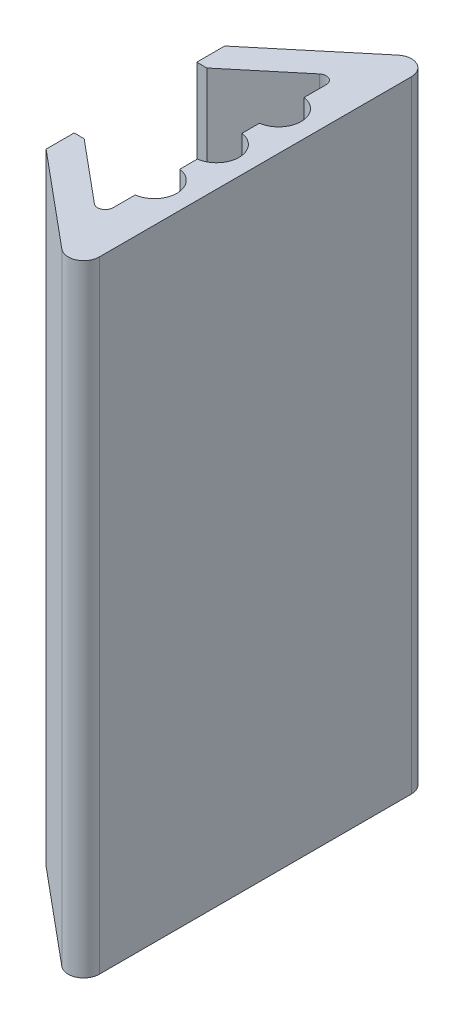
ISO-10303-21;
HEADER;
FILE_DESCRIPTION(('STEP AP214'),'2;1');
FILE_NAME('part.step','',(''),(''),'','','');
FILE_SCHEMA(('AUTOMOTIVE_DESIGN { 1 0 10303 214 1 1 1 1 }'));
ENDSEC;
DATA;
#1=APPLICATION_CONTEXT('core data for automotive mechanical design processes');
#2=APPLICATION_PROTOCOL_DEFINITION('international standard','automotive_design',2000,#1);
#3=PRODUCT_CONTEXT('',#1,'mechanical');
#4=PRODUCT('Part','Part','',(#3));
#5=PRODUCT_RELATED_PRODUCT_CATEGORY('part','',(#4));
#6=PRODUCT_DEFINITION_FORMATION('','',#4);
#7=PRODUCT_DEFINITION_CONTEXT('part definition',#1,'design');
#8=PRODUCT_DEFINITION('design','',#6,#7);
#9=PRODUCT_DEFINITION_SHAPE('','',#8);
#10=(LENGTH_UNIT() NAMED_UNIT(*) SI_UNIT(.MILLI.,.METRE.));
#11=(NAMED_UNIT(*) PLANE_ANGLE_UNIT() SI_UNIT($,.RADIAN.));
#12=(NAMED_UNIT(*) SI_UNIT($,.STERADIAN.) SOLID_ANGLE_UNIT());
#13=UNCERTAINTY_MEASURE_WITH_UNIT(LENGTH_MEASURE(1.E-05),#10,'distance_accuracy_value','');
#14=(GEOMETRIC_REPRESENTATION_CONTEXT(3) GLOBAL_UNCERTAINTY_ASSIGNED_CONTEXT((#13)) GLOBAL_UNIT_ASSIGNED_CONTEXT((#10,
#11,#12)) REPRESENTATION_CONTEXT('',''));
#15=CARTESIAN_POINT('',(0.,0.,0.));
#16=DIRECTION('',(0.,0.,1.));
#17=DIRECTION('',(1.,0.,0.));
#18=AXIS2_PLACEMENT_3D('',#15,#16,#17);
#19=CARTESIAN_POINT('',(29.4000000000002,80.,-3.94148179925068E-13));
#20=DIRECTION('',(-1.,0.,0.));
#21=DIRECTION('',(0.,0.,1.));
#22=AXIS2_PLACEMENT_3D('',#19,#20,#21);
#23=PLANE('',#22);
#24=DIRECTION('',(0.,0.,-1.));
#25=VECTOR('',#24,1.);
#26=CARTESIAN_POINT('',(29.4000000000002,0.,-3.94148179925068E-13));
#27=LINE('',#26,#25);
#28=CARTESIAN_POINT('',(29.4000000000003,0.,13.7189750324093));
#29=VERTEX_POINT('',#28);
#30=CARTESIAN_POINT('',(29.4000000000003,0.,10.872281323269));
#31=VERTEX_POINT('',#30);
#32=EDGE_CURVE('E200',#29,#31,#27,.T.);
#33=ORIENTED_EDGE('',*,*,#32,.F.);
#34=DIRECTION('',(0.,-1.,0.));
#35=VECTOR('',#34,1.);
#36=CARTESIAN_POINT('',(29.4000000000003,80.,13.7189750324093));
#37=LINE('',#36,#35);
#38=CARTESIAN_POINT('',(29.4000000000003,80.,13.7189750324093));
#39=VERTEX_POINT('',#38);
#40=EDGE_CURVE('E11',#39,#29,#37,.T.);
#41=ORIENTED_EDGE('',*,*,#40,.F.);
#42=DIRECTION('',(0.,0.,-1.));
#43=VECTOR('',#42,1.);
#44=CARTESIAN_POINT('',(29.4000000000002,80.,-3.94148179925068E-13));
#45=LINE('',#44,#43);
#46=CARTESIAN_POINT('',(29.4000000000003,80.,10.872281323269));
#47=VERTEX_POINT('',#46);
#48=EDGE_CURVE('E255',#39,#47,#45,.T.);
#49=ORIENTED_EDGE('',*,*,#48,.T.);
#50=DIRECTION('',(0.,-1.,0.));
#51=VECTOR('',#50,1.);
#52=CARTESIAN_POINT('',(29.4000000000003,80.,10.872281323269));
#53=LINE('',#52,#51);
#54=EDGE_CURVE('E50',#47,#31,#53,.T.);
#55=ORIENTED_EDGE('',*,*,#54,.T.);
#56=EDGE_LOOP('',(#33,#41,#49,#55));
#57=FACE_BOUND('',#56,.T.);
#58=ADVANCED_FACE('F34',(#57),#23,.T.);
#59=CARTESIAN_POINT('',(28.4000000000003,80.,13.7189750324093));
#60=DIRECTION('',(0.,-1.,0.));
#61=DIRECTION('',(0.,0.,-1.));
#62=AXIS2_PLACEMENT_3D('',#59,#60,#61);
#63=CYLINDRICAL_SURFACE('',#62,1.00000000000011);
#64=CARTESIAN_POINT('',(28.4000000000003,0.,13.7189750324093));
#65=DIRECTION('',(0.,1.,0.));
#66=DIRECTION('',(0.,0.,1.));
#67=AXIS2_PLACEMENT_3D('',#64,#65,#66);
#68=CIRCLE('',#67,1.00000000000011);
#69=CARTESIAN_POINT('',(27.7598156003355,0.,14.4871963120067));
#70=VERTEX_POINT('',#69);
#71=EDGE_CURVE('E202',#29,#70,#68,.F.);
#72=ORIENTED_EDGE('',*,*,#71,.T.);
#73=DIRECTION('',(0.,-1.,0.));
#74=VECTOR('',#73,1.);
#75=CARTESIAN_POINT('',(27.7598156003355,80.,14.4871963120067));
#76=LINE('',#75,#74);
#77=CARTESIAN_POINT('',(27.7598156003355,80.,14.4871963120067));
#78=VERTEX_POINT('',#77);
#79=EDGE_CURVE('E42',#78,#70,#76,.T.);
#80=ORIENTED_EDGE('',*,*,#79,.F.);
#81=CARTESIAN_POINT('',(28.4000000000003,80.,13.7189750324093));
#82=DIRECTION('',(0.,1.,0.));
#83=DIRECTION('',(0.,0.,1.));
#84=AXIS2_PLACEMENT_3D('',#81,#82,#83);
#85=CIRCLE('',#84,1.00000000000011);
#86=EDGE_CURVE('E569',#39,#78,#85,.F.);
#87=ORIENTED_EDGE('',*,*,#86,.F.);
#88=ORIENTED_EDGE('',*,*,#40,.T.);
#89=EDGE_LOOP('',(#72,#80,#87,#88));
#90=FACE_BOUND('',#89,.T.);
#91=ADVANCED_FACE('F296',(#90),#63,.F.);
#92=CARTESIAN_POINT('',(4.25212296144578,80.,-5.1025475537349));
#93=DIRECTION('',(0.640184399664482,0.,-0.768221279597374));
#94=DIRECTION('',(-0.768221279597374,0.,-0.640184399664482));
#95=AXIS2_PLACEMENT_3D('',#92,#93,#94);
#96=PLANE('',#95);
#97=DIRECTION('',(0.768221279597374,0.,0.640184399664483));
#98=VECTOR('',#97,1.);
#99=CARTESIAN_POINT('',(4.25212296144578,0.,-5.1025475537349));
#100=LINE('',#99,#98);
#101=CARTESIAN_POINT('',(19.8458182064329,0.,7.89219848375448));
#102=VERTEX_POINT('',#101);
#103=EDGE_CURVE('E205',#102,#70,#100,.T.);
#104=ORIENTED_EDGE('',*,*,#103,.F.);
#105=DIRECTION('',(0.,-1.,0.));
#106=VECTOR('',#105,1.);
#107=CARTESIAN_POINT('',(19.8458182064329,80.,7.89219848375448));
#108=LINE('',#107,#106);
#109=CARTESIAN_POINT('',(19.8458182064329,80.,7.89219848375448));
#110=VERTEX_POINT('',#109);
#111=EDGE_CURVE('E286',#110,#102,#108,.T.);
#112=ORIENTED_EDGE('',*,*,#111,.F.);
#113=DIRECTION('',(0.768221279597374,0.,0.640184399664483));
#114=VECTOR('',#113,1.);
#115=CARTESIAN_POINT('',(4.25212296144578,80.,-5.1025475537349));
#116=LINE('',#115,#114);
#117=EDGE_CURVE('E293',#110,#78,#116,.T.);
#118=ORIENTED_EDGE('',*,*,#117,.T.);
#119=ORIENTED_EDGE('',*,*,#79,.T.);
#120=EDGE_LOOP('',(#104,#112,#118,#119));
#121=FACE_BOUND('',#120,.T.);
#122=ADVANCED_FACE('F291',(#121),#96,.T.);
#123=CARTESIAN_POINT('',(1.48120780114814E-13,80.,7.89219848375486));
#124=DIRECTION('',(0.,0.,1.));
#125=DIRECTION('',(1.,0.,0.));
#126=AXIS2_PLACEMENT_3D('',#123,#124,#125);
#127=PLANE('',#126);
#128=DIRECTION('',(-1.,0.,0.));
#129=VECTOR('',#128,1.);
#130=CARTESIAN_POINT('',(1.48120780114814E-13,0.,7.89219848375486));
#131=LINE('',#130,#129);
#132=CARTESIAN_POINT('',(18.5518002592741,0.,7.89219848375451));
#133=VERTEX_POINT('',#132);
#134=EDGE_CURVE('E208',#102,#133,#131,.T.);
#135=ORIENTED_EDGE('',*,*,#134,.T.);
#136=DIRECTION('',(0.,-1.,0.));
#137=VECTOR('',#136,1.);
#138=CARTESIAN_POINT('',(18.5518002592741,80.,7.89219848375451));
#139=LINE('',#138,#137);
#140=CARTESIAN_POINT('',(18.5518002592741,80.,7.89219848375451));
#141=VERTEX_POINT('',#140);
#142=EDGE_CURVE('E283',#141,#133,#139,.T.);
#143=ORIENTED_EDGE('',*,*,#142,.F.);
#144=DIRECTION('',(-1.,0.,0.));
#145=VECTOR('',#144,1.);
#146=CARTESIAN_POINT('',(1.48120780114814E-13,80.,7.89219848375486));
#147=LINE('',#146,#145);
#148=EDGE_CURVE('E313',#110,#141,#147,.T.);
#149=ORIENTED_EDGE('',*,*,#148,.F.);
#150=ORIENTED_EDGE('',*,*,#111,.T.);
#151=EDGE_LOOP('',(#135,#143,#149,#150));
#152=FACE_BOUND('',#151,.T.);
#153=ADVANCED_FACE('F303',(#152),#127,.F.);
#154=CARTESIAN_POINT('',(18.5518002592741,80.,0.));
#155=DIRECTION('',(1.,0.,0.));
#156=DIRECTION('',(0.,0.,-1.));
#157=AXIS2_PLACEMENT_3D('',#154,#155,#156);
#158=PLANE('',#157);
#159=DIRECTION('',(0.,0.,1.));
#160=VECTOR('',#159,1.);
#161=CARTESIAN_POINT('',(18.5518002592741,0.,0.));
#162=LINE('',#161,#160);
#163=CARTESIAN_POINT('',(18.5518002592741,0.,11.4999999999995));
#164=VERTEX_POINT('',#163);
#165=EDGE_CURVE('E210',#133,#164,#162,.T.);
#166=ORIENTED_EDGE('',*,*,#165,.T.);
#167=DIRECTION('',(0.,-1.,0.));
#168=VECTOR('',#167,1.);
#169=CARTESIAN_POINT('',(18.5518002592741,80.,11.4999999999995));
#170=LINE('',#169,#168);
#171=CARTESIAN_POINT('',(18.5518002592741,80.,11.4999999999995));
#172=VERTEX_POINT('',#171);
#173=EDGE_CURVE('E281',#172,#164,#170,.T.);
#174=ORIENTED_EDGE('',*,*,#173,.F.);
#175=DIRECTION('',(0.,0.,1.));
#176=VECTOR('',#175,1.);
#177=CARTESIAN_POINT('',(18.5518002592741,80.,0.));
#178=LINE('',#177,#176);
#179=EDGE_CURVE('E309',#141,#172,#178,.T.);
#180=ORIENTED_EDGE('',*,*,#179,.F.);
#181=ORIENTED_EDGE('',*,*,#142,.T.);
#182=EDGE_LOOP('',(#166,#174,#180,#181));
#183=FACE_BOUND('',#182,.T.);
#184=ADVANCED_FACE('F307',(#183),#158,.F.);
#185=CARTESIAN_POINT('',(1.94745912265359,80.,-2.33695094718431));
#186=DIRECTION('',(-0.640184399664481,0.,0.768221279597375));
#187=DIRECTION('',(0.768221279597375,0.,0.640184399664481));
#188=AXIS2_PLACEMENT_3D('',#185,#186,#187);
#189=PLANE('',#188);
#190=DIRECTION('',(-0.768221279597375,0.,-0.640184399664481));
#191=VECTOR('',#190,1.);
#192=CARTESIAN_POINT('',(1.94745912265359,0.,-2.33695094718431));
#193=LINE('',#192,#191);
#194=CARTESIAN_POINT('',(30.719631200671,0.,21.6398591178303));
#195=VERTEX_POINT('',#194);
#196=EDGE_CURVE('E213',#195,#164,#193,.T.);
#197=ORIENTED_EDGE('',*,*,#196,.F.);
#198=DIRECTION('',(0.,-1.,0.));
#199=VECTOR('',#198,1.);
#200=CARTESIAN_POINT('',(30.719631200671,80.,21.6398591178303));
#201=LINE('',#200,#199);
#202=CARTESIAN_POINT('',(30.719631200671,80.,21.6398591178303));
#203=VERTEX_POINT('',#202);
#204=EDGE_CURVE('E279',#203,#195,#201,.T.);
#205=ORIENTED_EDGE('',*,*,#204,.F.);
#206=DIRECTION('',(-0.768221279597375,0.,-0.640184399664481));
#207=VECTOR('',#206,1.);
#208=CARTESIAN_POINT('',(1.94745912265359,80.,-2.33695094718431));
#209=LINE('',#208,#207);
#210=EDGE_CURVE('E312',#203,#172,#209,.T.);
#211=ORIENTED_EDGE('',*,*,#210,.T.);
#212=ORIENTED_EDGE('',*,*,#173,.T.);
#213=EDGE_LOOP('',(#197,#205,#211,#212));
#214=FACE_BOUND('',#213,.T.);
#215=ADVANCED_FACE('F373',(#214),#189,.T.);
#216=CARTESIAN_POINT('',(32.,80.,20.1034165586355));
#217=DIRECTION('',(0.,-1.,0.));
#218=DIRECTION('',(0.,0.,-1.));
#219=AXIS2_PLACEMENT_3D('',#216,#217,#218);
#220=CYLINDRICAL_SURFACE('',#219,2.);
#221=CARTESIAN_POINT('',(32.,0.,20.1034165586355));
#222=DIRECTION('',(0.,1.,0.));
#223=DIRECTION('',(0.,0.,1.));
#224=AXIS2_PLACEMENT_3D('',#221,#222,#223);
#225=CIRCLE('',#224,2.);
#226=CARTESIAN_POINT('',(34.,0.,20.1034165586355));
#227=VERTEX_POINT('',#226);
#228=EDGE_CURVE('E216',#227,#195,#225,.F.);
#229=ORIENTED_EDGE('',*,*,#228,.F.);
#230=DIRECTION('',(0.,-1.,0.));
#231=VECTOR('',#230,1.);
#232=CARTESIAN_POINT('',(34.,80.,20.1034165586355));
#233=LINE('',#232,#231);
#234=CARTESIAN_POINT('',(34.,80.,20.1034165586355));
#235=VERTEX_POINT('',#234);
#236=EDGE_CURVE('E277',#235,#227,#233,.T.);
#237=ORIENTED_EDGE('',*,*,#236,.F.);
#238=CARTESIAN_POINT('',(32.,80.,20.1034165586355));
#239=DIRECTION('',(0.,1.,0.));
#240=DIRECTION('',(0.,0.,1.));
#241=AXIS2_PLACEMENT_3D('',#238,#239,#240);
#242=CIRCLE('',#241,2.);
#243=EDGE_CURVE('E315',#235,#203,#242,.F.);
#244=ORIENTED_EDGE('',*,*,#243,.T.);
#245=ORIENTED_EDGE('',*,*,#204,.T.);
#246=EDGE_LOOP('',(#229,#237,#244,#245));
#247=FACE_BOUND('',#246,.T.);
#248=ADVANCED_FACE('F376',(#247),#220,.T.);
#249=CARTESIAN_POINT('',(34.,80.,0.));
#250=DIRECTION('',(1.,0.,0.));
#251=DIRECTION('',(0.,0.,-1.));
#252=AXIS2_PLACEMENT_3D('',#249,#250,#251);
#253=PLANE('',#252);
#254=DIRECTION('',(0.,0.,1.));
#255=VECTOR('',#254,1.);
#256=CARTESIAN_POINT('',(34.,0.,0.));
#257=LINE('',#256,#255);
#258=CARTESIAN_POINT('',(34.,0.,-20.1034165586355));
#259=VERTEX_POINT('',#258);
#260=EDGE_CURVE('E219',#259,#227,#257,.T.);
#261=ORIENTED_EDGE('',*,*,#260,.F.);
#262=DIRECTION('',(0.,-1.,0.));
#263=VECTOR('',#262,1.);
#264=CARTESIAN_POINT('',(34.,80.,-20.1034165586355));
#265=LINE('',#264,#263);
#266=CARTESIAN_POINT('',(34.,80.,-20.1034165586355));
#267=VERTEX_POINT('',#266);
#268=EDGE_CURVE('E275',#267,#259,#265,.T.);
#269=ORIENTED_EDGE('',*,*,#268,.F.);
#270=DIRECTION('',(0.,0.,1.));
#271=VECTOR('',#270,1.);
#272=CARTESIAN_POINT('',(34.,80.,0.));
#273=LINE('',#272,#271);
#274=EDGE_CURVE('E322',#267,#235,#273,.T.);
#275=ORIENTED_EDGE('',*,*,#274,.T.);
#276=ORIENTED_EDGE('',*,*,#236,.T.);
#277=EDGE_LOOP('',(#261,#269,#275,#276));
#278=FACE_BOUND('',#277,.T.);
#279=ADVANCED_FACE('F380',(#278),#253,.T.);
#280=CARTESIAN_POINT('',(32.,80.,-20.1034165586355));
#281=DIRECTION('',(0.,-1.,0.));
#282=DIRECTION('',(0.,0.,-1.));
#283=AXIS2_PLACEMENT_3D('',#280,#281,#282);
#284=CYLINDRICAL_SURFACE('',#283,2.);
#285=CARTESIAN_POINT('',(32.,0.,-20.1034165586355));
#286=DIRECTION('',(0.,1.,0.));
#287=DIRECTION('',(0.,0.,1.));
#288=AXIS2_PLACEMENT_3D('',#285,#286,#287);
#289=CIRCLE('',#288,2.);
#290=CARTESIAN_POINT('',(30.719631200671,0.,-21.6398591178303));
#291=VERTEX_POINT('',#290);
#292=EDGE_CURVE('E222',#259,#291,#289,.T.);
#293=ORIENTED_EDGE('',*,*,#292,.T.);
#294=DIRECTION('',(0.,-1.,0.));
#295=VECTOR('',#294,1.);
#296=CARTESIAN_POINT('',(30.719631200671,80.,-21.6398591178303));
#297=LINE('',#296,#295);
#298=CARTESIAN_POINT('',(30.719631200671,80.,-21.6398591178303));
#299=VERTEX_POINT('',#298);
#300=EDGE_CURVE('E273',#299,#291,#297,.T.);
#301=ORIENTED_EDGE('',*,*,#300,.F.);
#302=CARTESIAN_POINT('',(32.,80.,-20.1034165586355));
#303=DIRECTION('',(0.,1.,0.));
#304=DIRECTION('',(0.,0.,1.));
#305=AXIS2_PLACEMENT_3D('',#302,#303,#304);
#306=CIRCLE('',#305,2.);
#307=EDGE_CURVE('E325',#267,#299,#306,.T.);
#308=ORIENTED_EDGE('',*,*,#307,.F.);
#309=ORIENTED_EDGE('',*,*,#268,.T.);
#310=EDGE_LOOP('',(#293,#301,#308,#309));
#311=FACE_BOUND('',#310,.T.);
#312=ADVANCED_FACE('F384',(#311),#284,.T.);
#313=CARTESIAN_POINT('',(1.94745912265355,80.,2.33695094718426));
#314=DIRECTION('',(-0.64018439966448,0.,-0.768221279597376));
#315=DIRECTION('',(-0.768221279597376,0.,0.64018439966448));
#316=AXIS2_PLACEMENT_3D('',#313,#314,#315);
#317=PLANE('',#316);
#318=DIRECTION('',(0.768221279597376,0.,-0.64018439966448));
#319=VECTOR('',#318,1.);
#320=CARTESIAN_POINT('',(1.94745912265355,0.,2.33695094718426));
#321=LINE('',#320,#319);
#322=CARTESIAN_POINT('',(18.5518002592747,0.,-11.5));
#323=VERTEX_POINT('',#322);
#324=EDGE_CURVE('E225',#323,#291,#321,.T.);
#325=ORIENTED_EDGE('',*,*,#324,.F.);
#326=DIRECTION('',(0.,-1.,0.));
#327=VECTOR('',#326,1.);
#328=CARTESIAN_POINT('',(18.5518002592747,80.,-11.5));
#329=LINE('',#328,#327);
#330=CARTESIAN_POINT('',(18.5518002592747,80.,-11.5));
#331=VERTEX_POINT('',#330);
#332=EDGE_CURVE('E271',#331,#323,#329,.T.);
#333=ORIENTED_EDGE('',*,*,#332,.F.);
#334=DIRECTION('',(0.768221279597376,0.,-0.64018439966448));
#335=VECTOR('',#334,1.);
#336=CARTESIAN_POINT('',(1.94745912265355,80.,2.33695094718426));
#337=LINE('',#336,#335);
#338=EDGE_CURVE('E327',#331,#299,#337,.T.);
#339=ORIENTED_EDGE('',*,*,#338,.T.);
#340=ORIENTED_EDGE('',*,*,#300,.T.);
#341=EDGE_LOOP('',(#325,#333,#339,#340));
#342=FACE_BOUND('',#341,.T.);
#343=ADVANCED_FACE('F388',(#342),#317,.T.);
#344=CARTESIAN_POINT('',(18.5518002592747,80.,0.));
#345=DIRECTION('',(1.,0.,0.));
#346=DIRECTION('',(0.,0.,-1.));
#347=AXIS2_PLACEMENT_3D('',#344,#345,#346);
#348=PLANE('',#347);
#349=DIRECTION('',(0.,0.,1.));
#350=VECTOR('',#349,1.);
#351=CARTESIAN_POINT('',(18.5518002592747,0.,0.));
#352=LINE('',#351,#350);
#353=CARTESIAN_POINT('',(18.5518002592747,0.,-7.89999999999999));
#354=VERTEX_POINT('',#353);
#355=EDGE_CURVE('E228',#323,#354,#352,.T.);
#356=ORIENTED_EDGE('',*,*,#355,.T.);
#357=DIRECTION('',(0.,-1.,0.));
#358=VECTOR('',#357,1.);
#359=CARTESIAN_POINT('',(18.5518002592747,80.,-7.89999999999999));
#360=LINE('',#359,#358);
#361=CARTESIAN_POINT('',(18.5518002592747,80.,-7.89999999999999));
#362=VERTEX_POINT('',#361);
#363=EDGE_CURVE('E269',#362,#354,#360,.T.);
#364=ORIENTED_EDGE('',*,*,#363,.F.);
#365=DIRECTION('',(0.,0.,1.));
#366=VECTOR('',#365,1.);
#367=CARTESIAN_POINT('',(18.5518002592747,80.,0.));
#368=LINE('',#367,#366);
#369=EDGE_CURVE('E330',#331,#362,#368,.T.);
#370=ORIENTED_EDGE('',*,*,#369,.F.);
#371=ORIENTED_EDGE('',*,*,#332,.T.);
#372=EDGE_LOOP('',(#356,#364,#370,#371));
#373=FACE_BOUND('',#372,.T.);
#374=ADVANCED_FACE('F392',(#373),#348,.F.);
#375=CARTESIAN_POINT('',(0.,80.,-7.89999999999999));
#376=DIRECTION('',(0.,0.,1.));
#377=DIRECTION('',(1.,0.,0.));
#378=AXIS2_PLACEMENT_3D('',#375,#376,#377);
#379=PLANE('',#378);
#380=DIRECTION('',(-1.,0.,0.));
#381=VECTOR('',#380,1.);
#382=CARTESIAN_POINT('',(0.,0.,-7.89999999999999));
#383=LINE('',#382,#381);
#384=CARTESIAN_POINT('',(19.8551800259275,0.,-7.89999999999999));
#385=VERTEX_POINT('',#384);
#386=EDGE_CURVE('E231',#385,#354,#383,.T.);
#387=ORIENTED_EDGE('',*,*,#386,.F.);
#388=DIRECTION('',(0.,-1.,0.));
#389=VECTOR('',#388,1.);
#390=CARTESIAN_POINT('',(19.8551800259275,80.,-7.89999999999999));
#391=LINE('',#390,#389);
#392=CARTESIAN_POINT('',(19.8551800259275,80.,-7.89999999999999));
#393=VERTEX_POINT('',#392);
#394=EDGE_CURVE('E267',#393,#385,#391,.T.);
#395=ORIENTED_EDGE('',*,*,#394,.F.);
#396=DIRECTION('',(-1.,0.,0.));
#397=VECTOR('',#396,1.);
#398=CARTESIAN_POINT('',(0.,80.,-7.89999999999999));
#399=LINE('',#398,#397);
#400=EDGE_CURVE('E332',#393,#362,#399,.T.);
#401=ORIENTED_EDGE('',*,*,#400,.T.);
#402=ORIENTED_EDGE('',*,*,#363,.T.);
#403=EDGE_LOOP('',(#387,#395,#401,#402));
#404=FACE_BOUND('',#403,.T.);
#405=ADVANCED_FACE('F396',(#404),#379,.T.);
#406=CARTESIAN_POINT('',(4.25212296144568,80.,5.10254755373482));
#407=DIRECTION('',(0.64018439966448,0.,0.768221279597376));
#408=DIRECTION('',(0.768221279597376,0.,-0.64018439966448));
#409=AXIS2_PLACEMENT_3D('',#406,#407,#408);
#410=PLANE('',#409);
#411=DIRECTION('',(-0.768221279597376,0.,0.64018439966448));
#412=VECTOR('',#411,1.);
#413=CARTESIAN_POINT('',(4.25212296144568,0.,5.10254755373482));
#414=LINE('',#413,#412);
#415=CARTESIAN_POINT('',(27.7598156003355,0.,-14.4871963120067));
#416=VERTEX_POINT('',#415);
#417=EDGE_CURVE('E234',#416,#385,#414,.T.);
#418=ORIENTED_EDGE('',*,*,#417,.F.);
#419=DIRECTION('',(0.,-1.,0.));
#420=VECTOR('',#419,1.);
#421=CARTESIAN_POINT('',(27.7598156003355,80.,-14.4871963120067));
#422=LINE('',#421,#420);
#423=CARTESIAN_POINT('',(27.7598156003355,80.,-14.4871963120067));
#424=VERTEX_POINT('',#423);
#425=EDGE_CURVE('E265',#424,#416,#422,.T.);
#426=ORIENTED_EDGE('',*,*,#425,.F.);
#427=DIRECTION('',(-0.768221279597376,0.,0.64018439966448));
#428=VECTOR('',#427,1.);
#429=CARTESIAN_POINT('',(4.25212296144568,80.,5.10254755373482));
#430=LINE('',#429,#428);
#431=EDGE_CURVE('E335',#424,#393,#430,.T.);
#432=ORIENTED_EDGE('',*,*,#431,.T.);
#433=ORIENTED_EDGE('',*,*,#394,.T.);
#434=EDGE_LOOP('',(#418,#426,#432,#433));
#435=FACE_BOUND('',#434,.T.);
#436=ADVANCED_FACE('F400',(#435),#410,.T.);
#437=CARTESIAN_POINT('',(28.4,80.,-13.7189750324093));
#438=DIRECTION('',(0.,-1.,0.));
#439=DIRECTION('',(0.,0.,-1.));
#440=AXIS2_PLACEMENT_3D('',#437,#438,#439);
#441=CYLINDRICAL_SURFACE('',#440,0.999999999999997);
#442=CARTESIAN_POINT('',(28.4,0.,-13.7189750324093));
#443=DIRECTION('',(0.,1.,0.));
#444=DIRECTION('',(0.,0.,1.));
#445=AXIS2_PLACEMENT_3D('',#442,#443,#444);
#446=CIRCLE('',#445,0.999999999999997);
#447=CARTESIAN_POINT('',(29.4,0.,-13.7189750324093));
#448=VERTEX_POINT('',#447);
#449=EDGE_CURVE('E237',#448,#416,#446,.T.);
#450=ORIENTED_EDGE('',*,*,#449,.F.);
#451=DIRECTION('',(0.,-1.,0.));
#452=VECTOR('',#451,1.);
#453=CARTESIAN_POINT('',(29.4,80.,-13.7189750324093));
#454=LINE('',#453,#452);
#455=CARTESIAN_POINT('',(29.4,80.,-13.7189750324093));
#456=VERTEX_POINT('',#455);
#457=EDGE_CURVE('E263',#456,#448,#454,.T.);
#458=ORIENTED_EDGE('',*,*,#457,.F.);
#459=CARTESIAN_POINT('',(28.4,80.,-13.7189750324093));
#460=DIRECTION('',(0.,1.,0.));
#461=DIRECTION('',(0.,0.,1.));
#462=AXIS2_PLACEMENT_3D('',#459,#460,#461);
#463=CIRCLE('',#462,0.999999999999997);
#464=EDGE_CURVE('E338',#456,#424,#463,.T.);
#465=ORIENTED_EDGE('',*,*,#464,.T.);
#466=ORIENTED_EDGE('',*,*,#425,.T.);
#467=EDGE_LOOP('',(#450,#458,#465,#466));
#468=FACE_BOUND('',#467,.T.);
#469=ADVANCED_FACE('F404',(#468),#441,.F.);
#470=CARTESIAN_POINT('',(29.4,80.,0.));
#471=DIRECTION('',(-1.,0.,0.));
#472=DIRECTION('',(0.,0.,1.));
#473=AXIS2_PLACEMENT_3D('',#470,#471,#472);
#474=PLANE('',#473);
#475=DIRECTION('',(0.,0.,-1.));
#476=VECTOR('',#475,1.);
#477=CARTESIAN_POINT('',(29.4,0.,0.));
#478=LINE('',#477,#476);
#479=CARTESIAN_POINT('',(29.4,0.,-10.872281323269));
#480=VERTEX_POINT('',#479);
#481=EDGE_CURVE('E240',#480,#448,#478,.T.);
#482=ORIENTED_EDGE('',*,*,#481,.F.);
#483=DIRECTION('',(0.,-1.,0.));
#484=VECTOR('',#483,1.);
#485=CARTESIAN_POINT('',(29.4,80.,-10.872281323269));
#486=LINE('',#485,#484);
#487=CARTESIAN_POINT('',(29.4,80.,-10.872281323269));
#488=VERTEX_POINT('',#487);
#489=EDGE_CURVE('E261',#488,#480,#486,.T.);
#490=ORIENTED_EDGE('',*,*,#489,.F.);
#491=DIRECTION('',(0.,0.,-1.));
#492=VECTOR('',#491,1.);
#493=CARTESIAN_POINT('',(29.4,80.,0.));
#494=LINE('',#493,#492);
#495=EDGE_CURVE('E341',#488,#456,#494,.T.);
#496=ORIENTED_EDGE('',*,*,#495,.T.);
#497=ORIENTED_EDGE('',*,*,#457,.T.);
#498=EDGE_LOOP('',(#482,#490,#496,#497));
#499=FACE_BOUND('',#498,.T.);
#500=ADVANCED_FACE('F408',(#499),#474,.T.);
#501=CARTESIAN_POINT('',(29.,80.,-8.));
#502=DIRECTION('',(0.,-1.,0.));
#503=DIRECTION('',(0.,0.,-1.));
#504=AXIS2_PLACEMENT_3D('',#501,#502,#503);
#505=CYLINDRICAL_SURFACE('',#504,2.90000000000001);
#506=CARTESIAN_POINT('',(29.,0.,-8.));
#507=DIRECTION('',(0.,1.,0.));
#508=DIRECTION('',(0.,0.,1.));
#509=AXIS2_PLACEMENT_3D('',#506,#507,#508);
#510=CIRCLE('',#509,2.90000000000001);
#511=CARTESIAN_POINT('',(29.4000000000001,0.,-5.12771867673098));
#512=VERTEX_POINT('',#511);
#513=EDGE_CURVE('E243',#512,#480,#510,.T.);
#514=ORIENTED_EDGE('',*,*,#513,.F.);
#515=DIRECTION('',(0.,-1.,0.));
#516=VECTOR('',#515,1.);
#517=CARTESIAN_POINT('',(29.4000000000001,80.,-5.12771867673098));
#518=LINE('',#517,#516);
#519=CARTESIAN_POINT('',(29.4000000000001,80.,-5.12771867673098));
#520=VERTEX_POINT('',#519);
#521=EDGE_CURVE('E259',#520,#512,#518,.T.);
#522=ORIENTED_EDGE('',*,*,#521,.F.);
#523=CARTESIAN_POINT('',(29.,80.,-8.));
#524=DIRECTION('',(0.,1.,0.));
#525=DIRECTION('',(0.,0.,1.));
#526=AXIS2_PLACEMENT_3D('',#523,#524,#525);
#527=CIRCLE('',#526,2.90000000000001);
#528=EDGE_CURVE('E344',#520,#488,#527,.T.);
#529=ORIENTED_EDGE('',*,*,#528,.T.);
#530=ORIENTED_EDGE('',*,*,#489,.T.);
#531=EDGE_LOOP('',(#514,#522,#529,#530));
#532=FACE_BOUND('',#531,.T.);
#533=ADVANCED_FACE('F412',(#532),#505,.F.);
#534=CARTESIAN_POINT('',(29.4000000000002,80.,-3.61798531822201E-13));
#535=DIRECTION('',(-1.,0.,0.));
#536=DIRECTION('',(0.,0.,1.));
#537=AXIS2_PLACEMENT_3D('',#534,#535,#536);
#538=PLANE('',#537);
#539=DIRECTION('',(0.,0.,-1.));
#540=VECTOR('',#539,1.);
#541=CARTESIAN_POINT('',(29.4000000000002,0.,-3.61798531822201E-13));
#542=LINE('',#541,#540);
#543=CARTESIAN_POINT('',(29.4000000000001,0.,-2.872281323269));
#544=VERTEX_POINT('',#543);
#545=EDGE_CURVE('E246',#544,#512,#542,.T.);
#546=ORIENTED_EDGE('',*,*,#545,.F.);
#547=DIRECTION('',(0.,-1.,0.));
#548=VECTOR('',#547,1.);
#549=CARTESIAN_POINT('',(29.4000000000001,80.,-2.872281323269));
#550=LINE('',#549,#548);
#551=CARTESIAN_POINT('',(29.4000000000001,80.,-2.872281323269));
#552=VERTEX_POINT('',#551);
#553=EDGE_CURVE('E181',#552,#544,#550,.T.);
#554=ORIENTED_EDGE('',*,*,#553,.F.);
#555=DIRECTION('',(0.,0.,-1.));
#556=VECTOR('',#555,1.);
#557=CARTESIAN_POINT('',(29.4000000000002,80.,-3.61798531822201E-13));
#558=LINE('',#557,#556);
#559=EDGE_CURVE('E192',#552,#520,#558,.T.);
#560=ORIENTED_EDGE('',*,*,#559,.T.);
#561=ORIENTED_EDGE('',*,*,#521,.T.);
#562=EDGE_LOOP('',(#546,#554,#560,#561));
#563=FACE_BOUND('',#562,.T.);
#564=ADVANCED_FACE('F348',(#563),#538,.T.);
#565=CARTESIAN_POINT('',(29.,80.,0.));
#566=DIRECTION('',(0.,-1.,0.));
#567=DIRECTION('',(0.,0.,-1.));
#568=AXIS2_PLACEMENT_3D('',#565,#566,#567);
#569=CYLINDRICAL_SURFACE('',#568,2.9);
#570=CARTESIAN_POINT('',(29.,0.,0.));
#571=DIRECTION('',(0.,1.,0.));
#572=DIRECTION('',(0.,0.,1.));
#573=AXIS2_PLACEMENT_3D('',#570,#571,#572);
#574=CIRCLE('',#573,2.9);
#575=CARTESIAN_POINT('',(29.4000000000002,0.,2.87228132326898));
#576=VERTEX_POINT('',#575);
#577=EDGE_CURVE('E177',#576,#544,#574,.T.);
#578=ORIENTED_EDGE('',*,*,#577,.F.);
#579=DIRECTION('',(0.,-1.,0.));
#580=VECTOR('',#579,1.);
#581=CARTESIAN_POINT('',(29.4000000000002,80.,2.87228132326898));
#582=LINE('',#581,#580);
#583=CARTESIAN_POINT('',(29.4000000000002,80.,2.87228132326898));
#584=VERTEX_POINT('',#583);
#585=EDGE_CURVE('E172',#584,#576,#582,.T.);
#586=ORIENTED_EDGE('',*,*,#585,.F.);
#587=CARTESIAN_POINT('',(29.,80.,0.));
#588=DIRECTION('',(0.,1.,0.));
#589=DIRECTION('',(0.,0.,1.));
#590=AXIS2_PLACEMENT_3D('',#587,#588,#589);
#591=CIRCLE('',#590,2.9);
#592=EDGE_CURVE('E175',#584,#552,#591,.T.);
#593=ORIENTED_EDGE('',*,*,#592,.T.);
#594=ORIENTED_EDGE('',*,*,#553,.T.);
#595=EDGE_LOOP('',(#578,#586,#593,#594));
#596=FACE_BOUND('',#595,.T.);
#597=ADVANCED_FACE('F174',(#596),#569,.F.);
#598=CARTESIAN_POINT('',(29.4000000000002,80.,-3.61798531822193E-13));
#599=DIRECTION('',(-1.,0.,0.));
#600=DIRECTION('',(0.,0.,1.));
#601=AXIS2_PLACEMENT_3D('',#598,#599,#600);
#602=PLANE('',#601);
#603=DIRECTION('',(0.,0.,-1.));
#604=VECTOR('',#603,1.);
#605=CARTESIAN_POINT('',(29.4000000000002,0.,-3.61798531822193E-13));
#606=LINE('',#605,#604);
#607=CARTESIAN_POINT('',(29.4000000000002,0.,5.12771867673102));
#608=VERTEX_POINT('',#607);
#609=EDGE_CURVE('E250',#608,#576,#606,.T.);
#610=ORIENTED_EDGE('',*,*,#609,.F.);
#611=DIRECTION('',(0.,-1.,0.));
#612=VECTOR('',#611,1.);
#613=CARTESIAN_POINT('',(29.4000000000002,80.,5.12771867673102));
#614=LINE('',#613,#612);
#615=CARTESIAN_POINT('',(29.4000000000002,80.,5.12771867673102));
#616=VERTEX_POINT('',#615);
#617=EDGE_CURVE('E111',#616,#608,#614,.T.);
#618=ORIENTED_EDGE('',*,*,#617,.F.);
#619=DIRECTION('',(0.,0.,-1.));
#620=VECTOR('',#619,1.);
#621=CARTESIAN_POINT('',(29.4000000000002,80.,-3.61798531822193E-13));
#622=LINE('',#621,#620);
#623=EDGE_CURVE('E189',#616,#584,#622,.T.);
#624=ORIENTED_EDGE('',*,*,#623,.T.);
#625=ORIENTED_EDGE('',*,*,#585,.T.);
#626=EDGE_LOOP('',(#610,#618,#624,#625));
#627=FACE_BOUND('',#626,.T.);
#628=ADVANCED_FACE('F194',(#627),#602,.T.);
#629=CARTESIAN_POINT('',(29.,80.,8.));
#630=DIRECTION('',(0.,-1.,0.));
#631=DIRECTION('',(0.,0.,-1.));
#632=AXIS2_PLACEMENT_3D('',#629,#630,#631);
#633=CYLINDRICAL_SURFACE('',#632,2.9);
#634=CARTESIAN_POINT('',(29.,0.,8.));
#635=DIRECTION('',(0.,1.,0.));
#636=DIRECTION('',(0.,0.,1.));
#637=AXIS2_PLACEMENT_3D('',#634,#635,#636);
#638=CIRCLE('',#637,2.9);
#639=EDGE_CURVE('E252',#31,#608,#638,.T.);
#640=ORIENTED_EDGE('',*,*,#639,.F.);
#641=ORIENTED_EDGE('',*,*,#54,.F.);
#642=CARTESIAN_POINT('',(29.,80.,8.));
#643=DIRECTION('',(0.,1.,0.));
#644=DIRECTION('',(0.,0.,1.));
#645=AXIS2_PLACEMENT_3D('',#642,#643,#644);
#646=CIRCLE('',#645,2.9);
#647=EDGE_CURVE('E195',#47,#616,#646,.T.);
#648=ORIENTED_EDGE('',*,*,#647,.T.);
#649=ORIENTED_EDGE('',*,*,#617,.T.);
#650=EDGE_LOOP('',(#640,#641,#648,#649));
#651=FACE_BOUND('',#650,.T.);
#652=ADVANCED_FACE('F350',(#651),#633,.F.);
#653=CARTESIAN_POINT('',(0.,80.,0.));
#654=DIRECTION('',(0.,1.,0.));
#655=DIRECTION('',(0.,0.,1.));
#656=AXIS2_PLACEMENT_3D('',#653,#654,#655);
#657=PLANE('',#656);
#658=ORIENTED_EDGE('',*,*,#48,.F.);
#659=ORIENTED_EDGE('',*,*,#86,.T.);
#660=ORIENTED_EDGE('',*,*,#117,.F.);
#661=ORIENTED_EDGE('',*,*,#148,.T.);
#662=ORIENTED_EDGE('',*,*,#179,.T.);
#663=ORIENTED_EDGE('',*,*,#210,.F.);
#664=ORIENTED_EDGE('',*,*,#243,.F.);
#665=ORIENTED_EDGE('',*,*,#274,.F.);
#666=ORIENTED_EDGE('',*,*,#307,.T.);
#667=ORIENTED_EDGE('',*,*,#338,.F.);
#668=ORIENTED_EDGE('',*,*,#369,.T.);
#669=ORIENTED_EDGE('',*,*,#400,.F.);
#670=ORIENTED_EDGE('',*,*,#431,.F.);
#671=ORIENTED_EDGE('',*,*,#464,.F.);
#672=ORIENTED_EDGE('',*,*,#495,.F.);
#673=ORIENTED_EDGE('',*,*,#528,.F.);
#674=ORIENTED_EDGE('',*,*,#559,.F.);
#675=ORIENTED_EDGE('',*,*,#592,.F.);
#676=ORIENTED_EDGE('',*,*,#623,.F.);
#677=ORIENTED_EDGE('',*,*,#647,.F.);
#678=EDGE_LOOP('',(#658,#659,#660,#661,#662,#663,#664,#665,#666,#667,#668,#669,#670,#671,#672,
#673,#674,#675,#676,#677));
#679=FACE_BOUND('',#678,.T.);
#680=ADVANCED_FACE('F187',(#679),#657,.T.);
#681=CARTESIAN_POINT('',(0.,0.,0.));
#682=DIRECTION('',(0.,1.,0.));
#683=DIRECTION('',(0.,0.,1.));
#684=AXIS2_PLACEMENT_3D('',#681,#682,#683);
#685=PLANE('',#684);
#686=ORIENTED_EDGE('',*,*,#32,.T.);
#687=ORIENTED_EDGE('',*,*,#639,.T.);
#688=ORIENTED_EDGE('',*,*,#609,.T.);
#689=ORIENTED_EDGE('',*,*,#577,.T.);
#690=ORIENTED_EDGE('',*,*,#545,.T.);
#691=ORIENTED_EDGE('',*,*,#513,.T.);
#692=ORIENTED_EDGE('',*,*,#481,.T.);
#693=ORIENTED_EDGE('',*,*,#449,.T.);
#694=ORIENTED_EDGE('',*,*,#417,.T.);
#695=ORIENTED_EDGE('',*,*,#386,.T.);
#696=ORIENTED_EDGE('',*,*,#355,.F.);
#697=ORIENTED_EDGE('',*,*,#324,.T.);
#698=ORIENTED_EDGE('',*,*,#292,.F.);
#699=ORIENTED_EDGE('',*,*,#260,.T.);
#700=ORIENTED_EDGE('',*,*,#228,.T.);
#701=ORIENTED_EDGE('',*,*,#196,.T.);
#702=ORIENTED_EDGE('',*,*,#165,.F.);
#703=ORIENTED_EDGE('',*,*,#134,.F.);
#704=ORIENTED_EDGE('',*,*,#103,.T.);
#705=ORIENTED_EDGE('',*,*,#71,.F.);
#706=EDGE_LOOP('',(#686,#687,#688,#689,#690,#691,#692,#693,#694,#695,#696,#697,#698,#699,#700,
#701,#702,#703,#704,#705));
#707=FACE_BOUND('',#706,.T.);
#708=ADVANCED_FACE('F299',(#707),#685,.F.);
#709=CLOSED_SHELL('',(#58,#91,#122,#153,#184,#215,#248,#279,#312,#343,#374,#405,#436,#469,#500,
#533,#564,#597,#628,#652,#680,#708));
#710=MANIFOLD_SOLID_BREP('B2',#709);
#711=ADVANCED_BREP_SHAPE_REPRESENTATION('',(#18,#710),#14);
#712=SHAPE_DEFINITION_REPRESENTATION(#9,#711);
ENDSEC;
END-ISO-10303-21;
